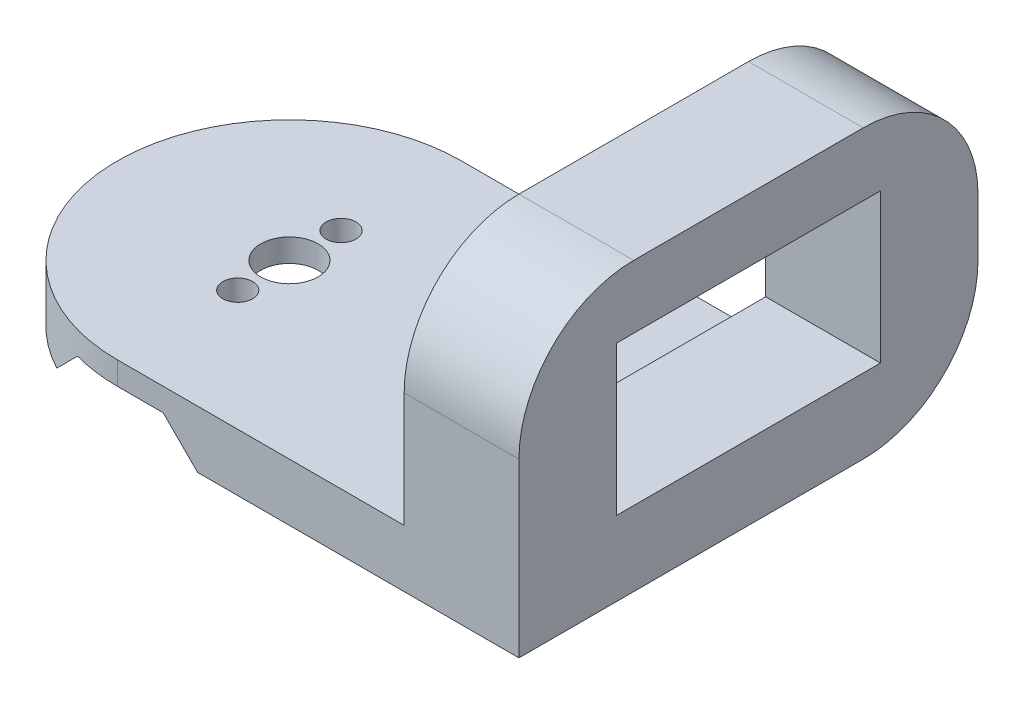
ISO-10303-21;
HEADER;
FILE_DESCRIPTION(('STEP AP214'),'2;1');
FILE_NAME('part.step','',(''),(''),'','','');
FILE_SCHEMA(('AUTOMOTIVE_DESIGN { 1 0 10303 214 1 1 1 1 }'));
ENDSEC;
DATA;
#1=APPLICATION_CONTEXT('core data for automotive mechanical design processes');
#2=APPLICATION_PROTOCOL_DEFINITION('international standard','automotive_design',2000,#1);
#3=PRODUCT_CONTEXT('',#1,'mechanical');
#4=PRODUCT('Part','Part','',(#3));
#5=PRODUCT_RELATED_PRODUCT_CATEGORY('part','',(#4));
#6=PRODUCT_DEFINITION_FORMATION('','',#4);
#7=PRODUCT_DEFINITION_CONTEXT('part definition',#1,'design');
#8=PRODUCT_DEFINITION('design','',#6,#7);
#9=PRODUCT_DEFINITION_SHAPE('','',#8);
#10=(LENGTH_UNIT() NAMED_UNIT(*) SI_UNIT(.MILLI.,.METRE.));
#11=(NAMED_UNIT(*) PLANE_ANGLE_UNIT() SI_UNIT($,.RADIAN.));
#12=(NAMED_UNIT(*) SI_UNIT($,.STERADIAN.) SOLID_ANGLE_UNIT());
#13=UNCERTAINTY_MEASURE_WITH_UNIT(LENGTH_MEASURE(1.E-05),#10,'distance_accuracy_value','');
#14=(GEOMETRIC_REPRESENTATION_CONTEXT(3) GLOBAL_UNCERTAINTY_ASSIGNED_CONTEXT((#13)) GLOBAL_UNIT_ASSIGNED_CONTEXT((#10,
#11,#12)) REPRESENTATION_CONTEXT('',''));
#15=CARTESIAN_POINT('',(0.,0.,0.));
#16=DIRECTION('',(0.,0.,1.));
#17=DIRECTION('',(1.,0.,0.));
#18=AXIS2_PLACEMENT_3D('',#15,#16,#17);
#19=CARTESIAN_POINT('',(0.,0.,0.));
#20=DIRECTION('',(0.,1.,0.));
#21=DIRECTION('',(0.,0.,1.));
#22=AXIS2_PLACEMENT_3D('',#19,#20,#21);
#23=PLANE('',#22);
#24=CARTESIAN_POINT('',(0.,0.,0.));
#25=DIRECTION('',(0.,1.,0.));
#26=DIRECTION('',(0.,0.,1.));
#27=AXIS2_PLACEMENT_3D('',#24,#25,#26);
#28=CIRCLE('',#27,15.);
#29=CARTESIAN_POINT('',(-7.,0.,-13.2664991614216));
#30=VERTEX_POINT('',#29);
#31=CARTESIAN_POINT('',(-7.,0.,13.2664991614216));
#32=VERTEX_POINT('',#31);
#33=EDGE_CURVE('E181',#30,#32,#28,.T.);
#34=ORIENTED_EDGE('',*,*,#33,.F.);
#35=DIRECTION('',(0.,0.,1.));
#36=VECTOR('',#35,1.);
#37=CARTESIAN_POINT('',(-7.,0.,-25.));
#38=LINE('',#37,#36);
#39=EDGE_CURVE('E228',#30,#32,#38,.T.);
#40=ORIENTED_EDGE('',*,*,#39,.T.);
#41=EDGE_LOOP('',(#34,#40));
#42=FACE_BOUND('',#41,.T.);
#43=ADVANCED_FACE('F34',(#42),#23,.F.);
#44=CARTESIAN_POINT('',(35.,0.,0.));
#45=DIRECTION('',(-1.,0.,0.));
#46=DIRECTION('',(0.,0.,1.));
#47=AXIS2_PLACEMENT_3D('',#44,#45,#46);
#48=PLANE('',#47);
#49=DIRECTION('',(0.,0.,-1.));
#50=VECTOR('',#49,1.);
#51=CARTESIAN_POINT('',(35.,0.,15.));
#52=LINE('',#51,#50);
#53=CARTESIAN_POINT('',(35.,0.,15.));
#54=VERTEX_POINT('',#53);
#55=CARTESIAN_POINT('',(35.,0.,-15.));
#56=VERTEX_POINT('',#55);
#57=EDGE_CURVE('E179',#54,#56,#52,.T.);
#58=ORIENTED_EDGE('',*,*,#57,.T.);
#59=CARTESIAN_POINT('',(35.,10.,-15.));
#60=DIRECTION('',(-1.,0.,0.));
#61=DIRECTION('',(0.,0.,1.));
#62=AXIS2_PLACEMENT_3D('',#59,#60,#61);
#63=CIRCLE('',#62,10.);
#64=CARTESIAN_POINT('',(35.,10.,-25.));
#65=VERTEX_POINT('',#64);
#66=EDGE_CURVE('E216',#56,#65,#63,.F.);
#67=ORIENTED_EDGE('',*,*,#66,.T.);
#68=DIRECTION('',(0.,1.,0.));
#69=VECTOR('',#68,1.);
#70=CARTESIAN_POINT('',(35.,0.,-25.));
#71=LINE('',#70,#69);
#72=CARTESIAN_POINT('',(35.,15.,-25.));
#73=VERTEX_POINT('',#72);
#74=EDGE_CURVE('E308',#65,#73,#71,.T.);
#75=ORIENTED_EDGE('',*,*,#74,.T.);
#76=CARTESIAN_POINT('',(35.,15.,-15.));
#77=DIRECTION('',(-1.,0.,0.));
#78=DIRECTION('',(0.,0.,1.));
#79=AXIS2_PLACEMENT_3D('',#76,#77,#78);
#80=CIRCLE('',#79,10.);
#81=CARTESIAN_POINT('',(35.,25.,-15.));
#82=VERTEX_POINT('',#81);
#83=EDGE_CURVE('E214',#73,#82,#80,.F.);
#84=ORIENTED_EDGE('',*,*,#83,.T.);
#85=DIRECTION('',(0.,0.,1.));
#86=VECTOR('',#85,1.);
#87=CARTESIAN_POINT('',(35.,25.,15.));
#88=LINE('',#87,#86);
#89=CARTESIAN_POINT('',(35.,25.,5.));
#90=VERTEX_POINT('',#89);
#91=EDGE_CURVE('E311',#82,#90,#88,.T.);
#92=ORIENTED_EDGE('',*,*,#91,.T.);
#93=CARTESIAN_POINT('',(35.,15.,5.));
#94=DIRECTION('',(-1.,0.,0.));
#95=DIRECTION('',(0.,0.,1.));
#96=AXIS2_PLACEMENT_3D('',#93,#94,#95);
#97=CIRCLE('',#96,10.);
#98=CARTESIAN_POINT('',(35.,15.,15.));
#99=VERTEX_POINT('',#98);
#100=EDGE_CURVE('E212',#90,#99,#97,.F.);
#101=ORIENTED_EDGE('',*,*,#100,.T.);
#102=DIRECTION('',(0.,-1.,0.));
#103=VECTOR('',#102,1.);
#104=CARTESIAN_POINT('',(35.,0.,15.));
#105=LINE('',#104,#103);
#106=EDGE_CURVE('E304',#99,#54,#105,.T.);
#107=ORIENTED_EDGE('',*,*,#106,.T.);
#108=EDGE_LOOP('',(#58,#67,#75,#84,#92,#101,#107));
#109=FACE_BOUND('',#108,.T.);
#110=DIRECTION('',(0.,-1.,0.));
#111=VECTOR('',#110,1.);
#112=CARTESIAN_POINT('',(35.,19.5,6.49999999999999));
#113=LINE('',#112,#111);
#114=CARTESIAN_POINT('',(35.,19.5,6.49999999999999));
#115=VERTEX_POINT('',#114);
#116=CARTESIAN_POINT('',(35.,6.5,6.49999999999999));
#117=VERTEX_POINT('',#116);
#118=EDGE_CURVE('E257',#115,#117,#113,.T.);
#119=ORIENTED_EDGE('',*,*,#118,.F.);
#120=DIRECTION('',(0.,0.,-1.));
#121=VECTOR('',#120,1.);
#122=CARTESIAN_POINT('',(35.,19.5,6.49999999999999));
#123=LINE('',#122,#121);
#124=CARTESIAN_POINT('',(35.,19.5,-16.5));
#125=VERTEX_POINT('',#124);
#126=EDGE_CURVE('E266',#115,#125,#123,.T.);
#127=ORIENTED_EDGE('',*,*,#126,.T.);
#128=DIRECTION('',(0.,-1.,0.));
#129=VECTOR('',#128,1.);
#130=CARTESIAN_POINT('',(35.,19.5,-16.5));
#131=LINE('',#130,#129);
#132=CARTESIAN_POINT('',(35.,6.5,-16.5));
#133=VERTEX_POINT('',#132);
#134=EDGE_CURVE('E263',#125,#133,#131,.T.);
#135=ORIENTED_EDGE('',*,*,#134,.T.);
#136=DIRECTION('',(0.,0.,-1.));
#137=VECTOR('',#136,1.);
#138=CARTESIAN_POINT('',(35.,6.5,6.49999999999999));
#139=LINE('',#138,#137);
#140=EDGE_CURVE('E260',#117,#133,#139,.T.);
#141=ORIENTED_EDGE('',*,*,#140,.F.);
#142=EDGE_LOOP('',(#119,#127,#135,#141));
#143=FACE_BOUND('',#142,.T.);
#144=ADVANCED_FACE('F356',(#109,#143),#48,.F.);
#145=CARTESIAN_POINT('',(25.,0.,0.));
#146=DIRECTION('',(-1.,0.,0.));
#147=DIRECTION('',(0.,0.,1.));
#148=AXIS2_PLACEMENT_3D('',#145,#146,#147);
#149=PLANE('',#148);
#150=CARTESIAN_POINT('',(25.,13.,8.99999999999999));
#151=DIRECTION('',(1.,0.,0.));
#152=DIRECTION('',(0.,0.,-1.));
#153=AXIS2_PLACEMENT_3D('',#150,#151,#152);
#154=CIRCLE('',#153,1.05);
#155=CARTESIAN_POINT('',(25.,13.,7.94999999999999));
#156=VERTEX_POINT('',#155);
#157=EDGE_CURVE('E274',#156,#156,#154,.T.);
#158=ORIENTED_EDGE('',*,*,#157,.T.);
#159=EDGE_LOOP('',(#158));
#160=FACE_BOUND('',#159,.T.);
#161=CARTESIAN_POINT('',(25.,13.,-19.));
#162=DIRECTION('',(1.,0.,0.));
#163=DIRECTION('',(0.,0.,-1.));
#164=AXIS2_PLACEMENT_3D('',#161,#162,#163);
#165=CIRCLE('',#164,1.05);
#166=CARTESIAN_POINT('',(25.,13.,-20.05));
#167=VERTEX_POINT('',#166);
#168=EDGE_CURVE('E277',#167,#167,#165,.T.);
#169=ORIENTED_EDGE('',*,*,#168,.T.);
#170=EDGE_LOOP('',(#169));
#171=FACE_BOUND('',#170,.T.);
#172=DIRECTION('',(0.,1.,0.));
#173=VECTOR('',#172,1.);
#174=CARTESIAN_POINT('',(25.,0.,-25.));
#175=LINE('',#174,#173);
#176=CARTESIAN_POINT('',(25.,10.,-25.));
#177=VERTEX_POINT('',#176);
#178=CARTESIAN_POINT('',(25.,15.,-25.));
#179=VERTEX_POINT('',#178);
#180=EDGE_CURVE('E315',#177,#179,#175,.T.);
#181=ORIENTED_EDGE('',*,*,#180,.F.);
#182=CARTESIAN_POINT('',(25.,10.,-15.));
#183=DIRECTION('',(-1.,0.,0.));
#184=DIRECTION('',(0.,0.,1.));
#185=AXIS2_PLACEMENT_3D('',#182,#183,#184);
#186=CIRCLE('',#185,10.);
#187=CARTESIAN_POINT('',(25.,0.,-15.));
#188=VERTEX_POINT('',#187);
#189=EDGE_CURVE('E208',#177,#188,#186,.T.);
#190=ORIENTED_EDGE('',*,*,#189,.T.);
#191=DIRECTION('',(0.,-1.,0.));
#192=VECTOR('',#191,1.);
#193=CARTESIAN_POINT('',(25.,5.,-15.));
#194=LINE('',#193,#192);
#195=CARTESIAN_POINT('',(25.,5.,-15.));
#196=VERTEX_POINT('',#195);
#197=EDGE_CURVE('E193',#196,#188,#194,.T.);
#198=ORIENTED_EDGE('',*,*,#197,.F.);
#199=DIRECTION('',(0.,0.,-1.));
#200=VECTOR('',#199,1.);
#201=CARTESIAN_POINT('',(25.,5.,-15.));
#202=LINE('',#201,#200);
#203=CARTESIAN_POINT('',(25.,5.,15.));
#204=VERTEX_POINT('',#203);
#205=EDGE_CURVE('E331',#204,#196,#202,.T.);
#206=ORIENTED_EDGE('',*,*,#205,.F.);
#207=DIRECTION('',(0.,-1.,0.));
#208=VECTOR('',#207,1.);
#209=CARTESIAN_POINT('',(25.,0.,15.));
#210=LINE('',#209,#208);
#211=CARTESIAN_POINT('',(25.,15.,15.));
#212=VERTEX_POINT('',#211);
#213=EDGE_CURVE('E303',#212,#204,#210,.T.);
#214=ORIENTED_EDGE('',*,*,#213,.F.);
#215=CARTESIAN_POINT('',(25.,15.,5.));
#216=DIRECTION('',(-1.,0.,0.));
#217=DIRECTION('',(0.,0.,1.));
#218=AXIS2_PLACEMENT_3D('',#215,#216,#217);
#219=CIRCLE('',#218,10.);
#220=CARTESIAN_POINT('',(25.,25.,5.));
#221=VERTEX_POINT('',#220);
#222=EDGE_CURVE('E204',#212,#221,#219,.T.);
#223=ORIENTED_EDGE('',*,*,#222,.T.);
#224=DIRECTION('',(0.,0.,1.));
#225=VECTOR('',#224,1.);
#226=CARTESIAN_POINT('',(25.,25.,15.));
#227=LINE('',#226,#225);
#228=CARTESIAN_POINT('',(25.,25.,-15.));
#229=VERTEX_POINT('',#228);
#230=EDGE_CURVE('E306',#229,#221,#227,.T.);
#231=ORIENTED_EDGE('',*,*,#230,.F.);
#232=CARTESIAN_POINT('',(25.,15.,-15.));
#233=DIRECTION('',(-1.,0.,0.));
#234=DIRECTION('',(0.,0.,1.));
#235=AXIS2_PLACEMENT_3D('',#232,#233,#234);
#236=CIRCLE('',#235,10.);
#237=EDGE_CURVE('E206',#229,#179,#236,.T.);
#238=ORIENTED_EDGE('',*,*,#237,.T.);
#239=EDGE_LOOP('',(#181,#190,#198,#206,#214,#223,#231,#238));
#240=FACE_BOUND('',#239,.T.);
#241=DIRECTION('',(0.,0.,-1.));
#242=VECTOR('',#241,1.);
#243=CARTESIAN_POINT('',(25.,19.5,6.5));
#244=LINE('',#243,#242);
#245=CARTESIAN_POINT('',(25.,19.5,6.5));
#246=VERTEX_POINT('',#245);
#247=CARTESIAN_POINT('',(25.,19.5,-16.5));
#248=VERTEX_POINT('',#247);
#249=EDGE_CURVE('E290',#246,#248,#244,.T.);
#250=ORIENTED_EDGE('',*,*,#249,.F.);
#251=DIRECTION('',(0.,-1.,0.));
#252=VECTOR('',#251,1.);
#253=CARTESIAN_POINT('',(25.,19.5,6.5));
#254=LINE('',#253,#252);
#255=CARTESIAN_POINT('',(25.,6.5,6.49999999999999));
#256=VERTEX_POINT('',#255);
#257=EDGE_CURVE('E273',#246,#256,#254,.T.);
#258=ORIENTED_EDGE('',*,*,#257,.T.);
#259=DIRECTION('',(0.,0.,-1.));
#260=VECTOR('',#259,1.);
#261=CARTESIAN_POINT('',(25.,6.5,6.49999999999999));
#262=LINE('',#261,#260);
#263=CARTESIAN_POINT('',(25.,6.5,-16.5));
#264=VERTEX_POINT('',#263);
#265=EDGE_CURVE('E284',#256,#264,#262,.T.);
#266=ORIENTED_EDGE('',*,*,#265,.T.);
#267=DIRECTION('',(0.,-1.,0.));
#268=VECTOR('',#267,1.);
#269=CARTESIAN_POINT('',(25.,19.5,-16.5));
#270=LINE('',#269,#268);
#271=EDGE_CURVE('E287',#248,#264,#270,.T.);
#272=ORIENTED_EDGE('',*,*,#271,.F.);
#273=EDGE_LOOP('',(#250,#258,#266,#272));
#274=FACE_BOUND('',#273,.T.);
#275=ADVANCED_FACE('F347',(#160,#171,#240,#274),#149,.T.);
#276=CARTESIAN_POINT('',(0.,5.,0.));
#277=DIRECTION('',(0.,1.,0.));
#278=DIRECTION('',(0.,0.,1.));
#279=AXIS2_PLACEMENT_3D('',#276,#277,#278);
#280=PLANE('',#279);
#281=CARTESIAN_POINT('',(0.,5.,0.));
#282=DIRECTION('',(0.,1.,0.));
#283=DIRECTION('',(0.,0.,1.));
#284=AXIS2_PLACEMENT_3D('',#281,#282,#283);
#285=CIRCLE('',#284,2.5);
#286=CARTESIAN_POINT('',(0.,5.,2.5));
#287=VERTEX_POINT('',#286);
#288=EDGE_CURVE('E321',#287,#287,#285,.T.);
#289=ORIENTED_EDGE('',*,*,#288,.F.);
#290=EDGE_LOOP('',(#289));
#291=FACE_BOUND('',#290,.T.);
#292=CARTESIAN_POINT('',(0.,5.,0.));
#293=DIRECTION('',(0.,1.,0.));
#294=DIRECTION('',(0.,0.,1.));
#295=AXIS2_PLACEMENT_3D('',#292,#293,#294);
#296=CIRCLE('',#295,15.);
#297=CARTESIAN_POINT('',(0.,5.,-15.));
#298=VERTEX_POINT('',#297);
#299=CARTESIAN_POINT('',(0.,5.,15.));
#300=VERTEX_POINT('',#299);
#301=EDGE_CURVE('E183',#298,#300,#296,.T.);
#302=ORIENTED_EDGE('',*,*,#301,.T.);
#303=DIRECTION('',(1.,0.,0.));
#304=VECTOR('',#303,1.);
#305=CARTESIAN_POINT('',(0.,5.,15.));
#306=LINE('',#305,#304);
#307=EDGE_CURVE('E328',#300,#204,#306,.T.);
#308=ORIENTED_EDGE('',*,*,#307,.T.);
#309=ORIENTED_EDGE('',*,*,#205,.T.);
#310=DIRECTION('',(-1.,0.,0.));
#311=VECTOR('',#310,1.);
#312=CARTESIAN_POINT('',(0.,5.,-15.));
#313=LINE('',#312,#311);
#314=EDGE_CURVE('E194',#196,#298,#313,.T.);
#315=ORIENTED_EDGE('',*,*,#314,.T.);
#316=EDGE_LOOP('',(#302,#308,#309,#315));
#317=FACE_BOUND('',#316,.T.);
#318=CARTESIAN_POINT('',(0.,5.,4.5));
#319=DIRECTION('',(0.,1.,0.));
#320=DIRECTION('',(0.,0.,1.));
#321=AXIS2_PLACEMENT_3D('',#318,#319,#320);
#322=CIRCLE('',#321,1.3);
#323=CARTESIAN_POINT('',(0.,5.,5.8));
#324=VERTEX_POINT('',#323);
#325=EDGE_CURVE('E186',#324,#324,#322,.T.);
#326=ORIENTED_EDGE('',*,*,#325,.F.);
#327=EDGE_LOOP('',(#326));
#328=FACE_BOUND('',#327,.T.);
#329=CARTESIAN_POINT('',(0.,5.,-4.5));
#330=DIRECTION('',(0.,1.,0.));
#331=DIRECTION('',(0.,0.,1.));
#332=AXIS2_PLACEMENT_3D('',#329,#330,#331);
#333=CIRCLE('',#332,1.3);
#334=CARTESIAN_POINT('',(0.,5.,-3.2));
#335=VERTEX_POINT('',#334);
#336=EDGE_CURVE('E313',#335,#335,#333,.T.);
#337=ORIENTED_EDGE('',*,*,#336,.F.);
#338=EDGE_LOOP('',(#337));
#339=FACE_BOUND('',#338,.T.);
#340=ADVANCED_FACE('F336',(#291,#317,#328,#339),#280,.T.);
#341=DIRECTION('',(1.,0.,0.));
#342=VECTOR('',#341,1.);
#343=CARTESIAN_POINT('',(0.,0.,15.));
#344=LINE('',#343,#342);
#345=CARTESIAN_POINT('',(7.,0.,15.));
#346=VERTEX_POINT('',#345);
#347=EDGE_CURVE('E173',#346,#54,#344,.T.);
#348=ORIENTED_EDGE('',*,*,#347,.F.);
#349=DIRECTION('',(0.,0.,1.));
#350=VECTOR('',#349,1.);
#351=CARTESIAN_POINT('',(7.,0.,-25.));
#352=LINE('',#351,#350);
#353=CARTESIAN_POINT('',(7.,0.,-15.));
#354=VERTEX_POINT('',#353);
#355=EDGE_CURVE('E156',#354,#346,#352,.T.);
#356=ORIENTED_EDGE('',*,*,#355,.F.);
#357=DIRECTION('',(-1.,0.,0.));
#358=VECTOR('',#357,1.);
#359=CARTESIAN_POINT('',(0.,0.,-15.));
#360=LINE('',#359,#358);
#361=EDGE_CURVE('E180',#188,#354,#360,.T.);
#362=ORIENTED_EDGE('',*,*,#361,.F.);
#363=DIRECTION('',(-1.,0.,0.));
#364=VECTOR('',#363,1.);
#365=CARTESIAN_POINT('',(0.,0.,-15.));
#366=LINE('',#365,#364);
#367=EDGE_CURVE('E210',#188,#56,#366,.F.);
#368=ORIENTED_EDGE('',*,*,#367,.T.);
#369=ORIENTED_EDGE('',*,*,#57,.F.);
#370=EDGE_LOOP('',(#348,#356,#362,#368,#369));
#371=FACE_BOUND('',#370,.T.);
#372=ADVANCED_FACE('F177',(#371),#23,.F.);
#373=CARTESIAN_POINT('',(0.,5.,0.));
#374=DIRECTION('',(0.,-1.,0.));
#375=DIRECTION('',(0.,0.,-1.));
#376=AXIS2_PLACEMENT_3D('',#373,#374,#375);
#377=CYLINDRICAL_SURFACE('',#376,15.);
#378=ORIENTED_EDGE('',*,*,#33,.T.);
#379=CARTESIAN_POINT('',(0.,7.00000000000008,0.));
#380=DIRECTION('',(-0.707106781186551,0.707106781186544,0.));
#381=DIRECTION('',(-0.707106781186544,-0.707106781186551,0.));
#382=AXIS2_PLACEMENT_3D('',#379,#380,#381);
#383=ELLIPSE('',#382,21.2132034355965,15.);
#384=CARTESIAN_POINT('',(-4.00000000000003,3.,14.456832294801));
#385=VERTEX_POINT('',#384);
#386=EDGE_CURVE('E11',#32,#385,#383,.T.);
#387=ORIENTED_EDGE('',*,*,#386,.T.);
#388=CARTESIAN_POINT('',(0.,3.,0.));
#389=DIRECTION('',(0.,1.,0.));
#390=DIRECTION('',(-1.,0.,0.));
#391=AXIS2_PLACEMENT_3D('',#388,#389,#390);
#392=CIRCLE('',#391,15.);
#393=CARTESIAN_POINT('',(0.,3.,15.));
#394=VERTEX_POINT('',#393);
#395=EDGE_CURVE('E256',#385,#394,#392,.T.);
#396=ORIENTED_EDGE('',*,*,#395,.T.);
#397=DIRECTION('',(0.,-1.,0.));
#398=VECTOR('',#397,1.);
#399=CARTESIAN_POINT('',(0.,5.,15.));
#400=LINE('',#399,#398);
#401=EDGE_CURVE('E197',#300,#394,#400,.T.);
#402=ORIENTED_EDGE('',*,*,#401,.F.);
#403=ORIENTED_EDGE('',*,*,#301,.F.);
#404=DIRECTION('',(0.,-1.,0.));
#405=VECTOR('',#404,1.);
#406=CARTESIAN_POINT('',(0.,5.,-15.));
#407=LINE('',#406,#405);
#408=CARTESIAN_POINT('',(0.,3.,-15.));
#409=VERTEX_POINT('',#408);
#410=EDGE_CURVE('E190',#298,#409,#407,.T.);
#411=ORIENTED_EDGE('',*,*,#410,.T.);
#412=CARTESIAN_POINT('',(-4.00000000000003,3.,-14.456832294801));
#413=VERTEX_POINT('',#412);
#414=EDGE_CURVE('E236',#409,#413,#392,.T.);
#415=ORIENTED_EDGE('',*,*,#414,.T.);
#416=EDGE_CURVE('E38',#413,#30,#383,.T.);
#417=ORIENTED_EDGE('',*,*,#416,.T.);
#418=EDGE_LOOP('',(#378,#387,#396,#402,#403,#411,#415,#417));
#419=FACE_BOUND('',#418,.T.);
#420=ADVANCED_FACE('F235',(#419),#377,.T.);
#421=CARTESIAN_POINT('',(0.,5.,15.));
#422=DIRECTION('',(0.,0.,-1.));
#423=DIRECTION('',(-1.,0.,0.));
#424=AXIS2_PLACEMENT_3D('',#421,#422,#423);
#425=PLANE('',#424);
#426=ORIENTED_EDGE('',*,*,#401,.T.);
#427=DIRECTION('',(-1.,0.,0.));
#428=VECTOR('',#427,1.);
#429=CARTESIAN_POINT('',(3.99999999999997,3.,15.));
#430=LINE('',#429,#428);
#431=CARTESIAN_POINT('',(3.99999999999997,3.,15.));
#432=VERTEX_POINT('',#431);
#433=EDGE_CURVE('E167',#432,#394,#430,.T.);
#434=ORIENTED_EDGE('',*,*,#433,.F.);
#435=DIRECTION('',(-0.707106781186551,0.707106781186544,0.));
#436=VECTOR('',#435,1.);
#437=CARTESIAN_POINT('',(7.,0.,15.));
#438=LINE('',#437,#436);
#439=EDGE_CURVE('E159',#346,#432,#438,.T.);
#440=ORIENTED_EDGE('',*,*,#439,.F.);
#441=ORIENTED_EDGE('',*,*,#347,.T.);
#442=ORIENTED_EDGE('',*,*,#106,.F.);
#443=DIRECTION('',(-1.,0.,0.));
#444=VECTOR('',#443,1.);
#445=CARTESIAN_POINT('',(0.,15.,15.));
#446=LINE('',#445,#444);
#447=EDGE_CURVE('E222',#99,#212,#446,.T.);
#448=ORIENTED_EDGE('',*,*,#447,.T.);
#449=ORIENTED_EDGE('',*,*,#213,.T.);
#450=ORIENTED_EDGE('',*,*,#307,.F.);
#451=EDGE_LOOP('',(#426,#434,#440,#441,#442,#448,#449,#450));
#452=FACE_BOUND('',#451,.T.);
#453=ADVANCED_FACE('F171',(#452),#425,.F.);
#454=CARTESIAN_POINT('',(0.,5.,-15.));
#455=DIRECTION('',(0.,0.,1.));
#456=DIRECTION('',(1.,0.,0.));
#457=AXIS2_PLACEMENT_3D('',#454,#455,#456);
#458=PLANE('',#457);
#459=DIRECTION('',(-0.707106781186551,0.707106781186544,0.));
#460=VECTOR('',#459,1.);
#461=CARTESIAN_POINT('',(0.99999999999996,5.99999999999997,-15.));
#462=LINE('',#461,#460);
#463=CARTESIAN_POINT('',(3.99999999999997,3.,-15.));
#464=VERTEX_POINT('',#463);
#465=EDGE_CURVE('E162',#354,#464,#462,.T.);
#466=ORIENTED_EDGE('',*,*,#465,.T.);
#467=DIRECTION('',(-1.,0.,0.));
#468=VECTOR('',#467,1.);
#469=CARTESIAN_POINT('',(0.,3.,-15.));
#470=LINE('',#469,#468);
#471=EDGE_CURVE('E253',#464,#409,#470,.T.);
#472=ORIENTED_EDGE('',*,*,#471,.T.);
#473=ORIENTED_EDGE('',*,*,#410,.F.);
#474=ORIENTED_EDGE('',*,*,#314,.F.);
#475=ORIENTED_EDGE('',*,*,#197,.T.);
#476=ORIENTED_EDGE('',*,*,#361,.T.);
#477=EDGE_LOOP('',(#466,#472,#473,#474,#475,#476));
#478=FACE_BOUND('',#477,.T.);
#479=ADVANCED_FACE('F341',(#478),#458,.F.);
#480=CARTESIAN_POINT('',(0.,5.,4.5));
#481=DIRECTION('',(0.,-1.,0.));
#482=DIRECTION('',(0.,0.,-1.));
#483=AXIS2_PLACEMENT_3D('',#480,#481,#482);
#484=CYLINDRICAL_SURFACE('',#483,1.3);
#485=CARTESIAN_POINT('',(0.,3.,4.5));
#486=DIRECTION('',(0.,1.,0.));
#487=DIRECTION('',(-1.,0.,0.));
#488=AXIS2_PLACEMENT_3D('',#485,#486,#487);
#489=CIRCLE('',#488,1.3);
#490=CARTESIAN_POINT('',(-1.3,3.,4.5));
#491=VERTEX_POINT('',#490);
#492=EDGE_CURVE('E250',#491,#491,#489,.T.);
#493=ORIENTED_EDGE('',*,*,#492,.F.);
#494=EDGE_LOOP('',(#493));
#495=FACE_BOUND('',#494,.T.);
#496=ORIENTED_EDGE('',*,*,#325,.T.);
#497=EDGE_LOOP('',(#496));
#498=FACE_BOUND('',#497,.T.);
#499=ADVANCED_FACE('F398',(#495,#498),#484,.F.);
#500=CARTESIAN_POINT('',(0.,5.,0.));
#501=DIRECTION('',(0.,-1.,0.));
#502=DIRECTION('',(0.,0.,-1.));
#503=AXIS2_PLACEMENT_3D('',#500,#501,#502);
#504=CYLINDRICAL_SURFACE('',#503,2.5);
#505=CARTESIAN_POINT('',(0.,3.,0.));
#506=DIRECTION('',(0.,1.,0.));
#507=DIRECTION('',(-1.,0.,0.));
#508=AXIS2_PLACEMENT_3D('',#505,#506,#507);
#509=CIRCLE('',#508,2.5);
#510=CARTESIAN_POINT('',(-2.5,3.,0.));
#511=VERTEX_POINT('',#510);
#512=EDGE_CURVE('E227',#511,#511,#509,.T.);
#513=ORIENTED_EDGE('',*,*,#512,.F.);
#514=EDGE_LOOP('',(#513));
#515=FACE_BOUND('',#514,.T.);
#516=ORIENTED_EDGE('',*,*,#288,.T.);
#517=EDGE_LOOP('',(#516));
#518=FACE_BOUND('',#517,.T.);
#519=ADVANCED_FACE('F401',(#515,#518),#504,.F.);
#520=CARTESIAN_POINT('',(0.,5.,-4.5));
#521=DIRECTION('',(0.,-1.,0.));
#522=DIRECTION('',(0.,0.,-1.));
#523=AXIS2_PLACEMENT_3D('',#520,#521,#522);
#524=CYLINDRICAL_SURFACE('',#523,1.3);
#525=CARTESIAN_POINT('',(0.,3.,-4.5));
#526=DIRECTION('',(0.,1.,0.));
#527=DIRECTION('',(-1.,0.,0.));
#528=AXIS2_PLACEMENT_3D('',#525,#526,#527);
#529=CIRCLE('',#528,1.3);
#530=CARTESIAN_POINT('',(-1.3,3.,-4.5));
#531=VERTEX_POINT('',#530);
#532=EDGE_CURVE('E225',#531,#531,#529,.T.);
#533=ORIENTED_EDGE('',*,*,#532,.F.);
#534=EDGE_LOOP('',(#533));
#535=FACE_BOUND('',#534,.T.);
#536=ORIENTED_EDGE('',*,*,#336,.T.);
#537=EDGE_LOOP('',(#536));
#538=FACE_BOUND('',#537,.T.);
#539=ADVANCED_FACE('F405',(#535,#538),#524,.F.);
#540=CARTESIAN_POINT('',(35.,0.,-25.));
#541=DIRECTION('',(0.,0.,1.));
#542=DIRECTION('',(1.,0.,0.));
#543=AXIS2_PLACEMENT_3D('',#540,#541,#542);
#544=PLANE('',#543);
#545=ORIENTED_EDGE('',*,*,#74,.F.);
#546=DIRECTION('',(-1.,0.,0.));
#547=VECTOR('',#546,1.);
#548=CARTESIAN_POINT('',(35.,10.,-25.));
#549=LINE('',#548,#547);
#550=EDGE_CURVE('E201',#65,#177,#549,.T.);
#551=ORIENTED_EDGE('',*,*,#550,.T.);
#552=ORIENTED_EDGE('',*,*,#180,.T.);
#553=DIRECTION('',(-1.,0.,0.));
#554=VECTOR('',#553,1.);
#555=CARTESIAN_POINT('',(35.,15.,-25.));
#556=LINE('',#555,#554);
#557=EDGE_CURVE('E199',#179,#73,#556,.F.);
#558=ORIENTED_EDGE('',*,*,#557,.T.);
#559=EDGE_LOOP('',(#545,#551,#552,#558));
#560=FACE_BOUND('',#559,.T.);
#561=ADVANCED_FACE('F360',(#560),#544,.F.);
#562=CARTESIAN_POINT('',(35.,25.,15.));
#563=DIRECTION('',(0.,-1.,0.));
#564=DIRECTION('',(0.,0.,-1.));
#565=AXIS2_PLACEMENT_3D('',#562,#563,#564);
#566=PLANE('',#565);
#567=ORIENTED_EDGE('',*,*,#91,.F.);
#568=DIRECTION('',(-1.,0.,0.));
#569=VECTOR('',#568,1.);
#570=CARTESIAN_POINT('',(35.,25.,-15.));
#571=LINE('',#570,#569);
#572=EDGE_CURVE('E219',#82,#229,#571,.T.);
#573=ORIENTED_EDGE('',*,*,#572,.T.);
#574=ORIENTED_EDGE('',*,*,#230,.T.);
#575=DIRECTION('',(-1.,0.,0.));
#576=VECTOR('',#575,1.);
#577=CARTESIAN_POINT('',(35.,25.,5.));
#578=LINE('',#577,#576);
#579=EDGE_CURVE('E57',#221,#90,#578,.F.);
#580=ORIENTED_EDGE('',*,*,#579,.T.);
#581=EDGE_LOOP('',(#567,#573,#574,#580));
#582=FACE_BOUND('',#581,.T.);
#583=ADVANCED_FACE('F366',(#582),#566,.F.);
#584=CARTESIAN_POINT('',(33.,19.5,6.49999999999999));
#585=DIRECTION('',(0.,0.,-1.));
#586=DIRECTION('',(-1.,0.,0.));
#587=AXIS2_PLACEMENT_3D('',#584,#585,#586);
#588=PLANE('',#587);
#589=ORIENTED_EDGE('',*,*,#257,.F.);
#590=DIRECTION('',(-1.,0.,0.));
#591=VECTOR('',#590,1.);
#592=CARTESIAN_POINT('',(33.,19.5,6.49999999999999));
#593=LINE('',#592,#591);
#594=EDGE_CURVE('E293',#115,#246,#593,.T.);
#595=ORIENTED_EDGE('',*,*,#594,.F.);
#596=ORIENTED_EDGE('',*,*,#118,.T.);
#597=DIRECTION('',(-1.,0.,0.));
#598=VECTOR('',#597,1.);
#599=CARTESIAN_POINT('',(33.,6.5,6.49999999999999));
#600=LINE('',#599,#598);
#601=EDGE_CURVE('E300',#117,#256,#600,.T.);
#602=ORIENTED_EDGE('',*,*,#601,.T.);
#603=EDGE_LOOP('',(#589,#595,#596,#602));
#604=FACE_BOUND('',#603,.T.);
#605=ADVANCED_FACE('F413',(#604),#588,.T.);
#606=CARTESIAN_POINT('',(33.,6.5,6.49999999999999));
#607=DIRECTION('',(0.,1.,0.));
#608=DIRECTION('',(0.,0.,1.));
#609=AXIS2_PLACEMENT_3D('',#606,#607,#608);
#610=PLANE('',#609);
#611=ORIENTED_EDGE('',*,*,#265,.F.);
#612=ORIENTED_EDGE('',*,*,#601,.F.);
#613=ORIENTED_EDGE('',*,*,#140,.T.);
#614=DIRECTION('',(-1.,0.,0.));
#615=VECTOR('',#614,1.);
#616=CARTESIAN_POINT('',(33.,6.5,-16.5));
#617=LINE('',#616,#615);
#618=EDGE_CURVE('E298',#133,#264,#617,.T.);
#619=ORIENTED_EDGE('',*,*,#618,.T.);
#620=EDGE_LOOP('',(#611,#612,#613,#619));
#621=FACE_BOUND('',#620,.T.);
#622=ADVANCED_FACE('F417',(#621),#610,.T.);
#623=CARTESIAN_POINT('',(33.,19.5,-16.5));
#624=DIRECTION('',(0.,0.,-1.));
#625=DIRECTION('',(-1.,0.,0.));
#626=AXIS2_PLACEMENT_3D('',#623,#624,#625);
#627=PLANE('',#626);
#628=ORIENTED_EDGE('',*,*,#271,.T.);
#629=ORIENTED_EDGE('',*,*,#618,.F.);
#630=ORIENTED_EDGE('',*,*,#134,.F.);
#631=DIRECTION('',(-1.,0.,0.));
#632=VECTOR('',#631,1.);
#633=CARTESIAN_POINT('',(33.,19.5,-16.5));
#634=LINE('',#633,#632);
#635=EDGE_CURVE('E296',#125,#248,#634,.T.);
#636=ORIENTED_EDGE('',*,*,#635,.T.);
#637=EDGE_LOOP('',(#628,#629,#630,#636));
#638=FACE_BOUND('',#637,.T.);
#639=ADVANCED_FACE('F421',(#638),#627,.F.);
#640=CARTESIAN_POINT('',(33.,19.5,6.49999999999999));
#641=DIRECTION('',(0.,1.,0.));
#642=DIRECTION('',(0.,0.,1.));
#643=AXIS2_PLACEMENT_3D('',#640,#641,#642);
#644=PLANE('',#643);
#645=ORIENTED_EDGE('',*,*,#249,.T.);
#646=ORIENTED_EDGE('',*,*,#635,.F.);
#647=ORIENTED_EDGE('',*,*,#126,.F.);
#648=ORIENTED_EDGE('',*,*,#594,.T.);
#649=EDGE_LOOP('',(#645,#646,#647,#648));
#650=FACE_BOUND('',#649,.T.);
#651=ADVANCED_FACE('F425',(#650),#644,.F.);
#652=CARTESIAN_POINT('',(33.,13.,-19.));
#653=DIRECTION('',(-1.,0.,0.));
#654=DIRECTION('',(0.,0.,1.));
#655=AXIS2_PLACEMENT_3D('',#652,#653,#654);
#656=CYLINDRICAL_SURFACE('',#655,1.05);
#657=CARTESIAN_POINT('',(33.,13.,-19.));
#658=DIRECTION('',(1.,0.,0.));
#659=DIRECTION('',(0.,0.,-1.));
#660=AXIS2_PLACEMENT_3D('',#657,#658,#659);
#661=CIRCLE('',#660,1.05);
#662=CARTESIAN_POINT('',(33.,13.,-20.05));
#663=VERTEX_POINT('',#662);
#664=EDGE_CURVE('E269',#663,#663,#661,.T.);
#665=ORIENTED_EDGE('',*,*,#664,.T.);
#666=EDGE_LOOP('',(#665));
#667=FACE_BOUND('',#666,.T.);
#668=ORIENTED_EDGE('',*,*,#168,.F.);
#669=EDGE_LOOP('',(#668));
#670=FACE_BOUND('',#669,.T.);
#671=ADVANCED_FACE('F429',(#667,#670),#656,.F.);
#672=CARTESIAN_POINT('',(33.,13.,-19.));
#673=DIRECTION('',(1.,0.,0.));
#674=DIRECTION('',(0.,0.,-1.));
#675=AXIS2_PLACEMENT_3D('',#672,#673,#674);
#676=PLANE('',#675);
#677=ORIENTED_EDGE('',*,*,#664,.F.);
#678=EDGE_LOOP('',(#677));
#679=FACE_BOUND('',#678,.T.);
#680=ADVANCED_FACE('F431',(#679),#676,.F.);
#681=CARTESIAN_POINT('',(33.,13.,8.99999999999999));
#682=DIRECTION('',(-1.,0.,0.));
#683=DIRECTION('',(0.,0.,1.));
#684=AXIS2_PLACEMENT_3D('',#681,#682,#683);
#685=CYLINDRICAL_SURFACE('',#684,1.05);
#686=CARTESIAN_POINT('',(33.,13.,8.99999999999999));
#687=DIRECTION('',(1.,0.,0.));
#688=DIRECTION('',(0.,0.,-1.));
#689=AXIS2_PLACEMENT_3D('',#686,#687,#688);
#690=CIRCLE('',#689,1.05);
#691=CARTESIAN_POINT('',(33.,13.,7.94999999999999));
#692=VERTEX_POINT('',#691);
#693=EDGE_CURVE('E270',#692,#692,#690,.T.);
#694=ORIENTED_EDGE('',*,*,#693,.T.);
#695=EDGE_LOOP('',(#694));
#696=FACE_BOUND('',#695,.T.);
#697=ORIENTED_EDGE('',*,*,#157,.F.);
#698=EDGE_LOOP('',(#697));
#699=FACE_BOUND('',#698,.T.);
#700=ADVANCED_FACE('F434',(#696,#699),#685,.F.);
#701=CARTESIAN_POINT('',(33.,13.,8.99999999999999));
#702=DIRECTION('',(1.,0.,0.));
#703=DIRECTION('',(0.,0.,-1.));
#704=AXIS2_PLACEMENT_3D('',#701,#702,#703);
#705=PLANE('',#704);
#706=ORIENTED_EDGE('',*,*,#693,.F.);
#707=EDGE_LOOP('',(#706));
#708=FACE_BOUND('',#707,.T.);
#709=ADVANCED_FACE('F441',(#708),#705,.F.);
#710=CARTESIAN_POINT('',(35.,10.,-15.));
#711=DIRECTION('',(-1.,0.,0.));
#712=DIRECTION('',(0.,0.,1.));
#713=AXIS2_PLACEMENT_3D('',#710,#711,#712);
#714=CYLINDRICAL_SURFACE('',#713,10.);
#715=ORIENTED_EDGE('',*,*,#66,.F.);
#716=ORIENTED_EDGE('',*,*,#367,.F.);
#717=ORIENTED_EDGE('',*,*,#189,.F.);
#718=ORIENTED_EDGE('',*,*,#550,.F.);
#719=EDGE_LOOP('',(#715,#716,#717,#718));
#720=FACE_BOUND('',#719,.T.);
#721=ADVANCED_FACE('F352',(#720),#714,.T.);
#722=CARTESIAN_POINT('',(35.,15.,-15.));
#723=DIRECTION('',(-1.,0.,0.));
#724=DIRECTION('',(0.,0.,1.));
#725=AXIS2_PLACEMENT_3D('',#722,#723,#724);
#726=CYLINDRICAL_SURFACE('',#725,10.);
#727=ORIENTED_EDGE('',*,*,#83,.F.);
#728=ORIENTED_EDGE('',*,*,#557,.F.);
#729=ORIENTED_EDGE('',*,*,#237,.F.);
#730=ORIENTED_EDGE('',*,*,#572,.F.);
#731=EDGE_LOOP('',(#727,#728,#729,#730));
#732=FACE_BOUND('',#731,.T.);
#733=ADVANCED_FACE('F363',(#732),#726,.T.);
#734=CARTESIAN_POINT('',(0.,15.,5.));
#735=DIRECTION('',(-1.,0.,0.));
#736=DIRECTION('',(0.,0.,1.));
#737=AXIS2_PLACEMENT_3D('',#734,#735,#736);
#738=CYLINDRICAL_SURFACE('',#737,10.);
#739=ORIENTED_EDGE('',*,*,#100,.F.);
#740=ORIENTED_EDGE('',*,*,#579,.F.);
#741=ORIENTED_EDGE('',*,*,#222,.F.);
#742=ORIENTED_EDGE('',*,*,#447,.F.);
#743=EDGE_LOOP('',(#739,#740,#741,#742));
#744=FACE_BOUND('',#743,.T.);
#745=ADVANCED_FACE('F36',(#744),#738,.T.);
#746=CARTESIAN_POINT('',(-4.00000000000003,3.,-25.));
#747=DIRECTION('',(-0.707106781186551,0.707106781186544,0.));
#748=DIRECTION('',(-0.707106781186544,-0.707106781186551,0.));
#749=AXIS2_PLACEMENT_3D('',#746,#747,#748);
#750=PLANE('',#749);
#751=ORIENTED_EDGE('',*,*,#39,.F.);
#752=ORIENTED_EDGE('',*,*,#416,.F.);
#753=DIRECTION('',(0.,0.,1.));
#754=VECTOR('',#753,1.);
#755=CARTESIAN_POINT('',(-4.00000000000003,3.,-25.));
#756=LINE('',#755,#754);
#757=EDGE_CURVE('E242',#413,#385,#756,.T.);
#758=ORIENTED_EDGE('',*,*,#757,.T.);
#759=ORIENTED_EDGE('',*,*,#386,.F.);
#760=EDGE_LOOP('',(#751,#752,#758,#759));
#761=FACE_BOUND('',#760,.T.);
#762=ADVANCED_FACE('F370',(#761),#750,.F.);
#763=CARTESIAN_POINT('',(7.,0.,-25.));
#764=DIRECTION('',(0.707106781186544,0.707106781186551,0.));
#765=DIRECTION('',(-0.707106781186551,0.707106781186544,0.));
#766=AXIS2_PLACEMENT_3D('',#763,#764,#765);
#767=PLANE('',#766);
#768=ORIENTED_EDGE('',*,*,#355,.T.);
#769=ORIENTED_EDGE('',*,*,#439,.T.);
#770=DIRECTION('',(0.,0.,1.));
#771=VECTOR('',#770,1.);
#772=CARTESIAN_POINT('',(3.99999999999997,3.,-25.));
#773=LINE('',#772,#771);
#774=EDGE_CURVE('E49',#464,#432,#773,.T.);
#775=ORIENTED_EDGE('',*,*,#774,.F.);
#776=ORIENTED_EDGE('',*,*,#465,.F.);
#777=EDGE_LOOP('',(#768,#769,#775,#776));
#778=FACE_BOUND('',#777,.T.);
#779=ADVANCED_FACE('F158',(#778),#767,.F.);
#780=CARTESIAN_POINT('',(3.99999999999997,3.,-25.));
#781=DIRECTION('',(0.,1.,0.));
#782=DIRECTION('',(-1.,0.,0.));
#783=AXIS2_PLACEMENT_3D('',#780,#781,#782);
#784=PLANE('',#783);
#785=ORIENTED_EDGE('',*,*,#492,.T.);
#786=EDGE_LOOP('',(#785));
#787=FACE_BOUND('',#786,.T.);
#788=ORIENTED_EDGE('',*,*,#512,.T.);
#789=EDGE_LOOP('',(#788));
#790=FACE_BOUND('',#789,.T.);
#791=ORIENTED_EDGE('',*,*,#532,.T.);
#792=EDGE_LOOP('',(#791));
#793=FACE_BOUND('',#792,.T.);
#794=ORIENTED_EDGE('',*,*,#757,.F.);
#795=ORIENTED_EDGE('',*,*,#414,.F.);
#796=ORIENTED_EDGE('',*,*,#471,.F.);
#797=ORIENTED_EDGE('',*,*,#774,.T.);
#798=ORIENTED_EDGE('',*,*,#433,.T.);
#799=ORIENTED_EDGE('',*,*,#395,.F.);
#800=EDGE_LOOP('',(#794,#795,#796,#797,#798,#799));
#801=FACE_BOUND('',#800,.T.);
#802=ADVANCED_FACE('F448',(#787,#790,#793,#801),#784,.F.);
#803=CLOSED_SHELL('',(#43,#144,#275,#340,#372,#420,#453,#479,#499,#519,#539,#561,#583,#605,#622,
#639,#651,#671,#680,#700,#709,#721,#733,#745,#762,#779,#802));
#804=MANIFOLD_SOLID_BREP('B2',#803);
#805=ADVANCED_BREP_SHAPE_REPRESENTATION('',(#18,#804),#14);
#806=SHAPE_DEFINITION_REPRESENTATION(#9,#805);
ENDSEC;
END-ISO-10303-21;
